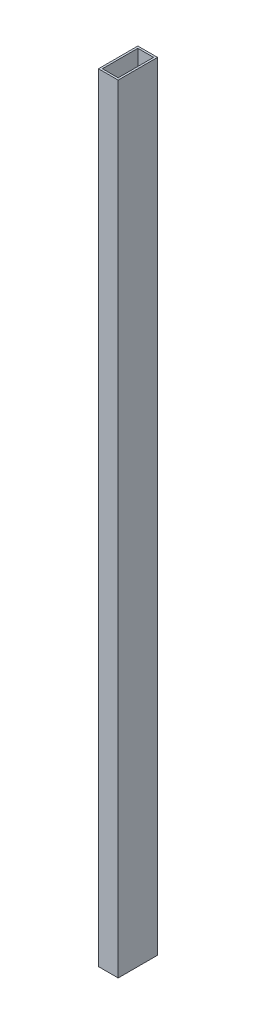
ISO-10303-21;
HEADER;
FILE_DESCRIPTION(('STEP AP214'),'2;1');
FILE_NAME('part.step','',(''),(''),'','','');
FILE_SCHEMA(('AUTOMOTIVE_DESIGN { 1 0 10303 214 1 1 1 1 }'));
ENDSEC;
DATA;
#1=APPLICATION_CONTEXT('core data for automotive mechanical design processes');
#2=APPLICATION_PROTOCOL_DEFINITION('international standard','automotive_design',2000,#1);
#3=PRODUCT_CONTEXT('',#1,'mechanical');
#4=PRODUCT('Part','Part','',(#3));
#5=PRODUCT_RELATED_PRODUCT_CATEGORY('part','',(#4));
#6=PRODUCT_DEFINITION_FORMATION('','',#4);
#7=PRODUCT_DEFINITION_CONTEXT('part definition',#1,'design');
#8=PRODUCT_DEFINITION('design','',#6,#7);
#9=PRODUCT_DEFINITION_SHAPE('','',#8);
#10=(LENGTH_UNIT() NAMED_UNIT(*) SI_UNIT(.MILLI.,.METRE.));
#11=(NAMED_UNIT(*) PLANE_ANGLE_UNIT() SI_UNIT($,.RADIAN.));
#12=(NAMED_UNIT(*) SI_UNIT($,.STERADIAN.) SOLID_ANGLE_UNIT());
#13=UNCERTAINTY_MEASURE_WITH_UNIT(LENGTH_MEASURE(1.E-05),#10,'distance_accuracy_value','');
#14=(GEOMETRIC_REPRESENTATION_CONTEXT(3) GLOBAL_UNCERTAINTY_ASSIGNED_CONTEXT((#13)) GLOBAL_UNIT_ASSIGNED_CONTEXT((#10,
#11,#12)) REPRESENTATION_CONTEXT('',''));
#15=CARTESIAN_POINT('',(0.,0.,0.));
#16=DIRECTION('',(0.,0.,1.));
#17=DIRECTION('',(1.,0.,0.));
#18=AXIS2_PLACEMENT_3D('',#15,#16,#17);
#19=CARTESIAN_POINT('',(0.,790.,0.));
#20=DIRECTION('',(0.,1.,0.));
#21=DIRECTION('',(0.,0.,1.));
#22=AXIS2_PLACEMENT_3D('',#19,#20,#21);
#23=PLANE('',#22);
#24=DIRECTION('',(0.,0.,-1.));
#25=VECTOR('',#24,1.);
#26=CARTESIAN_POINT('',(9.99999999999999,790.,-20.));
#27=LINE('',#26,#25);
#28=CARTESIAN_POINT('',(10.,790.,20.));
#29=VERTEX_POINT('',#28);
#30=CARTESIAN_POINT('',(9.99999999999999,790.,-20.));
#31=VERTEX_POINT('',#30);
#32=EDGE_CURVE('E160',#29,#31,#27,.T.);
#33=ORIENTED_EDGE('',*,*,#32,.T.);
#34=DIRECTION('',(-1.,0.,0.));
#35=VECTOR('',#34,1.);
#36=CARTESIAN_POINT('',(-10.,790.,-20.));
#37=LINE('',#36,#35);
#38=CARTESIAN_POINT('',(-10.,790.,-20.));
#39=VERTEX_POINT('',#38);
#40=EDGE_CURVE('E163',#31,#39,#37,.T.);
#41=ORIENTED_EDGE('',*,*,#40,.T.);
#42=DIRECTION('',(0.,0.,1.));
#43=VECTOR('',#42,1.);
#44=CARTESIAN_POINT('',(-10.,790.,-20.));
#45=LINE('',#44,#43);
#46=CARTESIAN_POINT('',(-10.,790.,20.));
#47=VERTEX_POINT('',#46);
#48=EDGE_CURVE('E166',#39,#47,#45,.T.);
#49=ORIENTED_EDGE('',*,*,#48,.T.);
#50=DIRECTION('',(1.,0.,0.));
#51=VECTOR('',#50,1.);
#52=CARTESIAN_POINT('',(-10.,790.,20.));
#53=LINE('',#52,#51);
#54=EDGE_CURVE('E168',#47,#29,#53,.T.);
#55=ORIENTED_EDGE('',*,*,#54,.T.);
#56=EDGE_LOOP('',(#33,#41,#49,#55));
#57=FACE_BOUND('',#56,.T.);
#58=DIRECTION('',(-1.,0.,0.));
#59=VECTOR('',#58,1.);
#60=CARTESIAN_POINT('',(-10.,790.,-18.));
#61=LINE('',#60,#59);
#62=CARTESIAN_POINT('',(7.99999999999999,790.,-18.));
#63=VERTEX_POINT('',#62);
#64=CARTESIAN_POINT('',(-8.00000000000001,790.,-18.));
#65=VERTEX_POINT('',#64);
#66=EDGE_CURVE('E132',#63,#65,#61,.T.);
#67=ORIENTED_EDGE('',*,*,#66,.F.);
#68=DIRECTION('',(0.,0.,-1.));
#69=VECTOR('',#68,1.);
#70=CARTESIAN_POINT('',(7.99999999999999,790.,-20.));
#71=LINE('',#70,#69);
#72=CARTESIAN_POINT('',(8.,790.,18.));
#73=VERTEX_POINT('',#72);
#74=EDGE_CURVE('E124',#73,#63,#71,.T.);
#75=ORIENTED_EDGE('',*,*,#74,.F.);
#76=DIRECTION('',(1.,0.,0.));
#77=VECTOR('',#76,1.);
#78=CARTESIAN_POINT('',(-10.,790.,18.));
#79=LINE('',#78,#77);
#80=CARTESIAN_POINT('',(-8.,790.,18.));
#81=VERTEX_POINT('',#80);
#82=EDGE_CURVE('E146',#81,#73,#79,.T.);
#83=ORIENTED_EDGE('',*,*,#82,.F.);
#84=DIRECTION('',(0.,0.,1.));
#85=VECTOR('',#84,1.);
#86=CARTESIAN_POINT('',(-8.00000000000001,790.,-20.));
#87=LINE('',#86,#85);
#88=EDGE_CURVE('E144',#65,#81,#87,.T.);
#89=ORIENTED_EDGE('',*,*,#88,.F.);
#90=EDGE_LOOP('',(#67,#75,#83,#89));
#91=FACE_BOUND('',#90,.T.);
#92=ADVANCED_FACE('F59',(#57,#91),#23,.T.);
#93=CARTESIAN_POINT('',(0.,0.,0.));
#94=DIRECTION('',(0.,1.,0.));
#95=DIRECTION('',(0.,0.,1.));
#96=AXIS2_PLACEMENT_3D('',#93,#94,#95);
#97=PLANE('',#96);
#98=DIRECTION('',(0.,0.,-1.));
#99=VECTOR('',#98,1.);
#100=CARTESIAN_POINT('',(9.99999999999999,0.,-20.));
#101=LINE('',#100,#99);
#102=CARTESIAN_POINT('',(10.,0.,20.));
#103=VERTEX_POINT('',#102);
#104=CARTESIAN_POINT('',(9.99999999999999,0.,-20.));
#105=VERTEX_POINT('',#104);
#106=EDGE_CURVE('E140',#103,#105,#101,.T.);
#107=ORIENTED_EDGE('',*,*,#106,.F.);
#108=DIRECTION('',(1.,0.,0.));
#109=VECTOR('',#108,1.);
#110=CARTESIAN_POINT('',(-10.,0.,20.));
#111=LINE('',#110,#109);
#112=CARTESIAN_POINT('',(-10.,0.,20.));
#113=VERTEX_POINT('',#112);
#114=EDGE_CURVE('E164',#113,#103,#111,.T.);
#115=ORIENTED_EDGE('',*,*,#114,.F.);
#116=DIRECTION('',(0.,0.,1.));
#117=VECTOR('',#116,1.);
#118=CARTESIAN_POINT('',(-10.,0.,-20.));
#119=LINE('',#118,#117);
#120=CARTESIAN_POINT('',(-10.,0.,-20.));
#121=VERTEX_POINT('',#120);
#122=EDGE_CURVE('E175',#121,#113,#119,.T.);
#123=ORIENTED_EDGE('',*,*,#122,.F.);
#124=DIRECTION('',(-1.,0.,0.));
#125=VECTOR('',#124,1.);
#126=CARTESIAN_POINT('',(-10.,0.,-20.));
#127=LINE('',#126,#125);
#128=EDGE_CURVE('E173',#105,#121,#127,.T.);
#129=ORIENTED_EDGE('',*,*,#128,.F.);
#130=EDGE_LOOP('',(#107,#115,#123,#129));
#131=FACE_BOUND('',#130,.T.);
#132=DIRECTION('',(0.,0.,-1.));
#133=VECTOR('',#132,1.);
#134=CARTESIAN_POINT('',(7.99999999999999,0.,-20.));
#135=LINE('',#134,#133);
#136=CARTESIAN_POINT('',(8.,0.,18.));
#137=VERTEX_POINT('',#136);
#138=CARTESIAN_POINT('',(7.99999999999999,0.,-18.));
#139=VERTEX_POINT('',#138);
#140=EDGE_CURVE('E82',#137,#139,#135,.T.);
#141=ORIENTED_EDGE('',*,*,#140,.T.);
#142=DIRECTION('',(-1.,0.,0.));
#143=VECTOR('',#142,1.);
#144=CARTESIAN_POINT('',(-10.,0.,-18.));
#145=LINE('',#144,#143);
#146=CARTESIAN_POINT('',(-8.00000000000001,0.,-18.));
#147=VERTEX_POINT('',#146);
#148=EDGE_CURVE('E139',#139,#147,#145,.T.);
#149=ORIENTED_EDGE('',*,*,#148,.T.);
#150=DIRECTION('',(0.,0.,1.));
#151=VECTOR('',#150,1.);
#152=CARTESIAN_POINT('',(-8.00000000000001,0.,-20.));
#153=LINE('',#152,#151);
#154=CARTESIAN_POINT('',(-8.,0.,18.));
#155=VERTEX_POINT('',#154);
#156=EDGE_CURVE('E152',#147,#155,#153,.T.);
#157=ORIENTED_EDGE('',*,*,#156,.T.);
#158=DIRECTION('',(1.,0.,0.));
#159=VECTOR('',#158,1.);
#160=CARTESIAN_POINT('',(-10.,0.,18.));
#161=LINE('',#160,#159);
#162=EDGE_CURVE('E133',#155,#137,#161,.T.);
#163=ORIENTED_EDGE('',*,*,#162,.T.);
#164=EDGE_LOOP('',(#141,#149,#157,#163));
#165=FACE_BOUND('',#164,.T.);
#166=ADVANCED_FACE('F193',(#131,#165),#97,.F.);
#167=CARTESIAN_POINT('',(9.99999999999999,790.,-20.));
#168=DIRECTION('',(-1.,0.,0.));
#169=DIRECTION('',(0.,0.,1.));
#170=AXIS2_PLACEMENT_3D('',#167,#168,#169);
#171=PLANE('',#170);
#172=ORIENTED_EDGE('',*,*,#106,.T.);
#173=DIRECTION('',(0.,-1.,0.));
#174=VECTOR('',#173,1.);
#175=CARTESIAN_POINT('',(9.99999999999999,790.,-20.));
#176=LINE('',#175,#174);
#177=EDGE_CURVE('E12',#31,#105,#176,.T.);
#178=ORIENTED_EDGE('',*,*,#177,.F.);
#179=ORIENTED_EDGE('',*,*,#32,.F.);
#180=DIRECTION('',(0.,-1.,0.));
#181=VECTOR('',#180,1.);
#182=CARTESIAN_POINT('',(10.,790.,20.));
#183=LINE('',#182,#181);
#184=EDGE_CURVE('E170',#29,#103,#183,.T.);
#185=ORIENTED_EDGE('',*,*,#184,.T.);
#186=EDGE_LOOP('',(#172,#178,#179,#185));
#187=FACE_BOUND('',#186,.T.);
#188=ADVANCED_FACE('F61',(#187),#171,.F.);
#189=CARTESIAN_POINT('',(-10.,790.,-20.));
#190=DIRECTION('',(0.,0.,1.));
#191=DIRECTION('',(1.,0.,0.));
#192=AXIS2_PLACEMENT_3D('',#189,#190,#191);
#193=PLANE('',#192);
#194=ORIENTED_EDGE('',*,*,#128,.T.);
#195=DIRECTION('',(0.,-1.,0.));
#196=VECTOR('',#195,1.);
#197=CARTESIAN_POINT('',(-10.,790.,-20.));
#198=LINE('',#197,#196);
#199=EDGE_CURVE('E67',#39,#121,#198,.T.);
#200=ORIENTED_EDGE('',*,*,#199,.F.);
#201=ORIENTED_EDGE('',*,*,#40,.F.);
#202=ORIENTED_EDGE('',*,*,#177,.T.);
#203=EDGE_LOOP('',(#194,#200,#201,#202));
#204=FACE_BOUND('',#203,.T.);
#205=ADVANCED_FACE('F203',(#204),#193,.F.);
#206=CARTESIAN_POINT('',(-10.,790.,-20.));
#207=DIRECTION('',(1.,0.,0.));
#208=DIRECTION('',(0.,0.,-1.));
#209=AXIS2_PLACEMENT_3D('',#206,#207,#208);
#210=PLANE('',#209);
#211=ORIENTED_EDGE('',*,*,#122,.T.);
#212=DIRECTION('',(0.,-1.,0.));
#213=VECTOR('',#212,1.);
#214=CARTESIAN_POINT('',(-10.,790.,20.));
#215=LINE('',#214,#213);
#216=EDGE_CURVE('E180',#47,#113,#215,.T.);
#217=ORIENTED_EDGE('',*,*,#216,.F.);
#218=ORIENTED_EDGE('',*,*,#48,.F.);
#219=ORIENTED_EDGE('',*,*,#199,.T.);
#220=EDGE_LOOP('',(#211,#217,#218,#219));
#221=FACE_BOUND('',#220,.T.);
#222=ADVANCED_FACE('F187',(#221),#210,.F.);
#223=CARTESIAN_POINT('',(-10.,790.,20.));
#224=DIRECTION('',(0.,0.,-1.));
#225=DIRECTION('',(-1.,0.,0.));
#226=AXIS2_PLACEMENT_3D('',#223,#224,#225);
#227=PLANE('',#226);
#228=ORIENTED_EDGE('',*,*,#114,.T.);
#229=ORIENTED_EDGE('',*,*,#184,.F.);
#230=ORIENTED_EDGE('',*,*,#54,.F.);
#231=ORIENTED_EDGE('',*,*,#216,.T.);
#232=EDGE_LOOP('',(#228,#229,#230,#231));
#233=FACE_BOUND('',#232,.T.);
#234=ADVANCED_FACE('F197',(#233),#227,.F.);
#235=CARTESIAN_POINT('',(7.99999999999999,790.,-20.));
#236=DIRECTION('',(-1.,0.,0.));
#237=DIRECTION('',(0.,0.,1.));
#238=AXIS2_PLACEMENT_3D('',#235,#236,#237);
#239=PLANE('',#238);
#240=ORIENTED_EDGE('',*,*,#140,.F.);
#241=DIRECTION('',(0.,-1.,0.));
#242=VECTOR('',#241,1.);
#243=CARTESIAN_POINT('',(8.,790.,18.));
#244=LINE('',#243,#242);
#245=EDGE_CURVE('E128',#73,#137,#244,.T.);
#246=ORIENTED_EDGE('',*,*,#245,.F.);
#247=ORIENTED_EDGE('',*,*,#74,.T.);
#248=DIRECTION('',(0.,-1.,0.));
#249=VECTOR('',#248,1.);
#250=CARTESIAN_POINT('',(7.99999999999999,790.,-18.));
#251=LINE('',#250,#249);
#252=EDGE_CURVE('E127',#63,#139,#251,.T.);
#253=ORIENTED_EDGE('',*,*,#252,.T.);
#254=EDGE_LOOP('',(#240,#246,#247,#253));
#255=FACE_BOUND('',#254,.T.);
#256=ADVANCED_FACE('F126',(#255),#239,.T.);
#257=CARTESIAN_POINT('',(-10.,790.,-18.));
#258=DIRECTION('',(0.,0.,1.));
#259=DIRECTION('',(1.,0.,0.));
#260=AXIS2_PLACEMENT_3D('',#257,#258,#259);
#261=PLANE('',#260);
#262=ORIENTED_EDGE('',*,*,#148,.F.);
#263=ORIENTED_EDGE('',*,*,#252,.F.);
#264=ORIENTED_EDGE('',*,*,#66,.T.);
#265=DIRECTION('',(0.,-1.,0.));
#266=VECTOR('',#265,1.);
#267=CARTESIAN_POINT('',(-8.00000000000001,790.,-18.));
#268=LINE('',#267,#266);
#269=EDGE_CURVE('E141',#65,#147,#268,.T.);
#270=ORIENTED_EDGE('',*,*,#269,.T.);
#271=EDGE_LOOP('',(#262,#263,#264,#270));
#272=FACE_BOUND('',#271,.T.);
#273=ADVANCED_FACE('F136',(#272),#261,.T.);
#274=CARTESIAN_POINT('',(-8.00000000000001,790.,-20.));
#275=DIRECTION('',(1.,0.,0.));
#276=DIRECTION('',(0.,0.,-1.));
#277=AXIS2_PLACEMENT_3D('',#274,#275,#276);
#278=PLANE('',#277);
#279=ORIENTED_EDGE('',*,*,#156,.F.);
#280=ORIENTED_EDGE('',*,*,#269,.F.);
#281=ORIENTED_EDGE('',*,*,#88,.T.);
#282=DIRECTION('',(0.,-1.,0.));
#283=VECTOR('',#282,1.);
#284=CARTESIAN_POINT('',(-8.,790.,18.));
#285=LINE('',#284,#283);
#286=EDGE_CURVE('E74',#81,#155,#285,.T.);
#287=ORIENTED_EDGE('',*,*,#286,.T.);
#288=EDGE_LOOP('',(#279,#280,#281,#287));
#289=FACE_BOUND('',#288,.T.);
#290=ADVANCED_FACE('F226',(#289),#278,.T.);
#291=CARTESIAN_POINT('',(-10.,790.,18.));
#292=DIRECTION('',(0.,0.,-1.));
#293=DIRECTION('',(-1.,0.,0.));
#294=AXIS2_PLACEMENT_3D('',#291,#292,#293);
#295=PLANE('',#294);
#296=ORIENTED_EDGE('',*,*,#162,.F.);
#297=ORIENTED_EDGE('',*,*,#286,.F.);
#298=ORIENTED_EDGE('',*,*,#82,.T.);
#299=ORIENTED_EDGE('',*,*,#245,.T.);
#300=EDGE_LOOP('',(#296,#297,#298,#299));
#301=FACE_BOUND('',#300,.T.);
#302=ADVANCED_FACE('F230',(#301),#295,.T.);
#303=CLOSED_SHELL('',(#92,#166,#188,#205,#222,#234,#256,#273,#290,#302));
#304=MANIFOLD_SOLID_BREP('B2',#303);
#305=ADVANCED_BREP_SHAPE_REPRESENTATION('',(#18,#304),#14);
#306=SHAPE_DEFINITION_REPRESENTATION(#9,#305);
ENDSEC;
END-ISO-10303-21;
